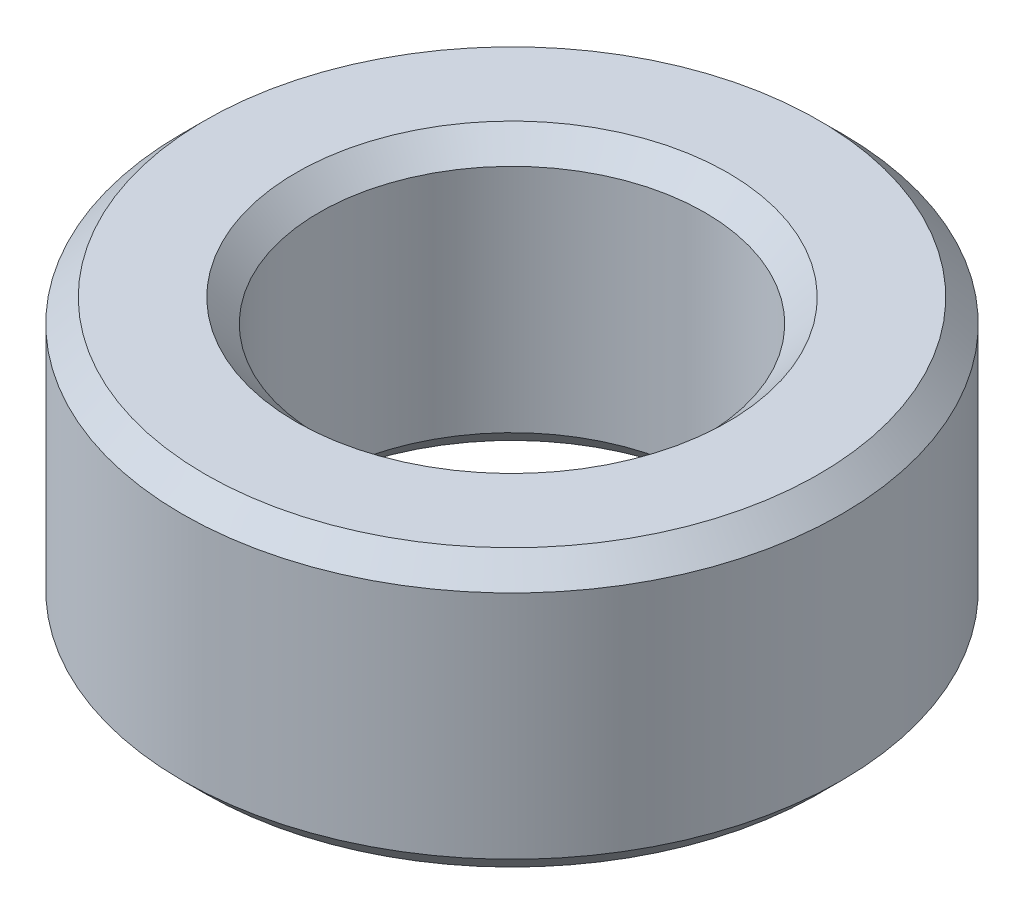
ISO-10303-21;
HEADER;
FILE_DESCRIPTION(('STEP AP214'),'2;1');
FILE_NAME('part.step','',(''),(''),'','','');
FILE_SCHEMA(('AUTOMOTIVE_DESIGN { 1 0 10303 214 1 1 1 1 }'));
ENDSEC;
DATA;
#1=APPLICATION_CONTEXT('core data for automotive mechanical design processes');
#2=APPLICATION_PROTOCOL_DEFINITION('international standard','automotive_design',2000,#1);
#3=PRODUCT_CONTEXT('',#1,'mechanical');
#4=PRODUCT('Part','Part','',(#3));
#5=PRODUCT_RELATED_PRODUCT_CATEGORY('part','',(#4));
#6=PRODUCT_DEFINITION_FORMATION('','',#4);
#7=PRODUCT_DEFINITION_CONTEXT('part definition',#1,'design');
#8=PRODUCT_DEFINITION('design','',#6,#7);
#9=PRODUCT_DEFINITION_SHAPE('','',#8);
#10=(LENGTH_UNIT() NAMED_UNIT(*) SI_UNIT(.MILLI.,.METRE.));
#11=(NAMED_UNIT(*) PLANE_ANGLE_UNIT() SI_UNIT($,.RADIAN.));
#12=(NAMED_UNIT(*) SI_UNIT($,.STERADIAN.) SOLID_ANGLE_UNIT());
#13=UNCERTAINTY_MEASURE_WITH_UNIT(LENGTH_MEASURE(1.E-05),#10,'distance_accuracy_value','');
#14=(GEOMETRIC_REPRESENTATION_CONTEXT(3) GLOBAL_UNCERTAINTY_ASSIGNED_CONTEXT((#13)) GLOBAL_UNIT_ASSIGNED_CONTEXT((#10,
#11,#12)) REPRESENTATION_CONTEXT('',''));
#15=CARTESIAN_POINT('',(0.,0.,0.));
#16=DIRECTION('',(0.,0.,1.));
#17=DIRECTION('',(1.,0.,0.));
#18=AXIS2_PLACEMENT_3D('',#15,#16,#17);
#19=CARTESIAN_POINT('',(0.,12.5840814717846,0.));
#20=DIRECTION('',(0.,-1.,0.));
#21=DIRECTION('',(0.,0.,-1.));
#22=AXIS2_PLACEMENT_3D('',#19,#20,#21);
#23=CYLINDRICAL_SURFACE('',#22,15.);
#24=CARTESIAN_POINT('',(0.,1.04542617216051,0.));
#25=DIRECTION('',(0.,1.,0.));
#26=DIRECTION('',(0.,0.,1.));
#27=AXIS2_PLACEMENT_3D('',#24,#25,#26);
#28=CIRCLE('',#27,15.);
#29=CARTESIAN_POINT('',(0.,1.04542617216051,15.));
#30=VERTEX_POINT('',#29);
#31=EDGE_CURVE('E10',#30,#30,#28,.T.);
#32=ORIENTED_EDGE('',*,*,#31,.T.);
#33=EDGE_LOOP('',(#32));
#34=FACE_BOUND('',#33,.T.);
#35=CARTESIAN_POINT('',(0.,11.538655299624,0.));
#36=DIRECTION('',(0.,1.,0.));
#37=DIRECTION('',(0.,0.,1.));
#38=AXIS2_PLACEMENT_3D('',#35,#36,#37);
#39=CIRCLE('',#38,15.);
#40=CARTESIAN_POINT('',(0.,11.538655299624,15.));
#41=VERTEX_POINT('',#40);
#42=EDGE_CURVE('E50',#41,#41,#39,.F.);
#43=ORIENTED_EDGE('',*,*,#42,.T.);
#44=EDGE_LOOP('',(#43));
#45=FACE_BOUND('',#44,.T.);
#46=ADVANCED_FACE('F39',(#34,#45),#23,.T.);
#47=CARTESIAN_POINT('',(0.,12.5840814717846,0.));
#48=DIRECTION('',(0.,1.,0.));
#49=DIRECTION('',(0.,0.,1.));
#50=AXIS2_PLACEMENT_3D('',#47,#48,#49);
#51=PLANE('',#50);
#52=CARTESIAN_POINT('',(0.,12.5840814717846,0.));
#53=DIRECTION('',(0.,1.,0.));
#54=DIRECTION('',(0.,0.,1.));
#55=AXIS2_PLACEMENT_3D('',#52,#53,#54);
#56=CIRCLE('',#55,9.82006643871301);
#57=CARTESIAN_POINT('',(0.,12.5840814717846,9.82006643871301));
#58=VERTEX_POINT('',#57);
#59=EDGE_CURVE('E58',#58,#58,#56,.F.);
#60=ORIENTED_EDGE('',*,*,#59,.T.);
#61=EDGE_LOOP('',(#60));
#62=FACE_BOUND('',#61,.T.);
#63=CARTESIAN_POINT('',(0.,12.5840814717846,0.));
#64=DIRECTION('',(0.,1.,0.));
#65=DIRECTION('',(0.,0.,1.));
#66=AXIS2_PLACEMENT_3D('',#63,#64,#65);
#67=CIRCLE('',#66,13.9545738278395);
#68=CARTESIAN_POINT('',(0.,12.5840814717846,13.9545738278395));
#69=VERTEX_POINT('',#68);
#70=EDGE_CURVE('E61',#69,#69,#67,.T.);
#71=ORIENTED_EDGE('',*,*,#70,.T.);
#72=EDGE_LOOP('',(#71));
#73=FACE_BOUND('',#72,.T.);
#74=ADVANCED_FACE('F88',(#62,#73),#51,.T.);
#75=CARTESIAN_POINT('',(0.,0.,0.));
#76=DIRECTION('',(0.,1.,0.));
#77=DIRECTION('',(0.,0.,1.));
#78=AXIS2_PLACEMENT_3D('',#75,#76,#77);
#79=PLANE('',#78);
#80=CARTESIAN_POINT('',(0.,0.,0.));
#81=DIRECTION('',(0.,1.,0.));
#82=DIRECTION('',(0.,0.,1.));
#83=AXIS2_PLACEMENT_3D('',#80,#81,#82);
#84=CIRCLE('',#83,9.82006643871301);
#85=CARTESIAN_POINT('',(0.,0.,9.82006643871301));
#86=VERTEX_POINT('',#85);
#87=EDGE_CURVE('E51',#86,#86,#84,.T.);
#88=ORIENTED_EDGE('',*,*,#87,.T.);
#89=EDGE_LOOP('',(#88));
#90=FACE_BOUND('',#89,.T.);
#91=CARTESIAN_POINT('',(0.,0.,0.));
#92=DIRECTION('',(0.,1.,0.));
#93=DIRECTION('',(0.,0.,1.));
#94=AXIS2_PLACEMENT_3D('',#91,#92,#93);
#95=CIRCLE('',#94,13.9545738278395);
#96=CARTESIAN_POINT('',(0.,0.,13.9545738278395));
#97=VERTEX_POINT('',#96);
#98=EDGE_CURVE('E54',#97,#97,#95,.F.);
#99=ORIENTED_EDGE('',*,*,#98,.T.);
#100=EDGE_LOOP('',(#99));
#101=FACE_BOUND('',#100,.T.);
#102=ADVANCED_FACE('F83',(#90,#101),#79,.F.);
#103=CARTESIAN_POINT('',(0.,12.5840814717846,0.));
#104=DIRECTION('',(0.,-1.,0.));
#105=DIRECTION('',(0.,0.,-1.));
#106=AXIS2_PLACEMENT_3D('',#103,#104,#105);
#107=CYLINDRICAL_SURFACE('',#106,8.77464026655249);
#108=CARTESIAN_POINT('',(0.,11.538655299624,0.));
#109=DIRECTION('',(0.,1.,0.));
#110=DIRECTION('',(0.,0.,1.));
#111=AXIS2_PLACEMENT_3D('',#108,#109,#110);
#112=CIRCLE('',#111,8.77464026655249);
#113=CARTESIAN_POINT('',(0.,11.538655299624,8.77464026655249));
#114=VERTEX_POINT('',#113);
#115=EDGE_CURVE('E67',#114,#114,#112,.T.);
#116=ORIENTED_EDGE('',*,*,#115,.T.);
#117=EDGE_LOOP('',(#116));
#118=FACE_BOUND('',#117,.T.);
#119=CARTESIAN_POINT('',(0.,1.04542617216053,0.));
#120=DIRECTION('',(0.,1.,0.));
#121=DIRECTION('',(0.,0.,1.));
#122=AXIS2_PLACEMENT_3D('',#119,#120,#121);
#123=CIRCLE('',#122,8.77464026655249);
#124=CARTESIAN_POINT('',(0.,1.04542617216053,8.77464026655249));
#125=VERTEX_POINT('',#124);
#126=EDGE_CURVE('E69',#125,#125,#123,.F.);
#127=ORIENTED_EDGE('',*,*,#126,.T.);
#128=EDGE_LOOP('',(#127));
#129=FACE_BOUND('',#128,.T.);
#130=ADVANCED_FACE('F71',(#118,#129),#107,.F.);
#131=CARTESIAN_POINT('',(0.,11.538655299624,0.));
#132=DIRECTION('',(0.,1.,0.));
#133=DIRECTION('',(0.,0.,1.));
#134=AXIS2_PLACEMENT_3D('',#131,#132,#133);
#135=CONICAL_SURFACE('',#134,8.77464026655249,0.785398163397451);
#136=ORIENTED_EDGE('',*,*,#59,.F.);
#137=EDGE_LOOP('',(#136));
#138=FACE_BOUND('',#137,.T.);
#139=ORIENTED_EDGE('',*,*,#115,.F.);
#140=EDGE_LOOP('',(#139));
#141=FACE_BOUND('',#140,.T.);
#142=ADVANCED_FACE('F77',(#138,#141),#135,.F.);
#143=CARTESIAN_POINT('',(0.,0.,0.));
#144=DIRECTION('',(0.,-1.,0.));
#145=DIRECTION('',(0.,0.,-1.));
#146=AXIS2_PLACEMENT_3D('',#143,#144,#145);
#147=CONICAL_SURFACE('',#146,9.82006643871301,0.785398163397444);
#148=ORIENTED_EDGE('',*,*,#126,.F.);
#149=EDGE_LOOP('',(#148));
#150=FACE_BOUND('',#149,.T.);
#151=ORIENTED_EDGE('',*,*,#87,.F.);
#152=EDGE_LOOP('',(#151));
#153=FACE_BOUND('',#152,.T.);
#154=ADVANCED_FACE('F73',(#150,#153),#147,.F.);
#155=CARTESIAN_POINT('',(0.,1.04542617216051,0.));
#156=DIRECTION('',(0.,1.,0.));
#157=DIRECTION('',(0.,0.,1.));
#158=AXIS2_PLACEMENT_3D('',#155,#156,#157);
#159=CONICAL_SURFACE('',#158,15.,0.785398163397453);
#160=ORIENTED_EDGE('',*,*,#98,.F.);
#161=EDGE_LOOP('',(#160));
#162=FACE_BOUND('',#161,.T.);
#163=ORIENTED_EDGE('',*,*,#31,.F.);
#164=EDGE_LOOP('',(#163));
#165=FACE_BOUND('',#164,.T.);
#166=ADVANCED_FACE('F76',(#162,#165),#159,.T.);
#167=CARTESIAN_POINT('',(0.,12.5840814717846,0.));
#168=DIRECTION('',(0.,-1.,0.));
#169=DIRECTION('',(0.,0.,-1.));
#170=AXIS2_PLACEMENT_3D('',#167,#168,#169);
#171=CONICAL_SURFACE('',#170,13.9545738278395,0.785398163397444);
#172=ORIENTED_EDGE('',*,*,#42,.F.);
#173=EDGE_LOOP('',(#172));
#174=FACE_BOUND('',#173,.T.);
#175=ORIENTED_EDGE('',*,*,#70,.F.);
#176=EDGE_LOOP('',(#175));
#177=FACE_BOUND('',#176,.T.);
#178=ADVANCED_FACE('F45',(#174,#177),#171,.T.);
#179=CLOSED_SHELL('',(#46,#74,#102,#130,#142,#154,#166,#178));
#180=MANIFOLD_SOLID_BREP('B2',#179);
#181=ADVANCED_BREP_SHAPE_REPRESENTATION('',(#18,#180),#14);
#182=SHAPE_DEFINITION_REPRESENTATION(#9,#181);
ENDSEC;
END-ISO-10303-21;
